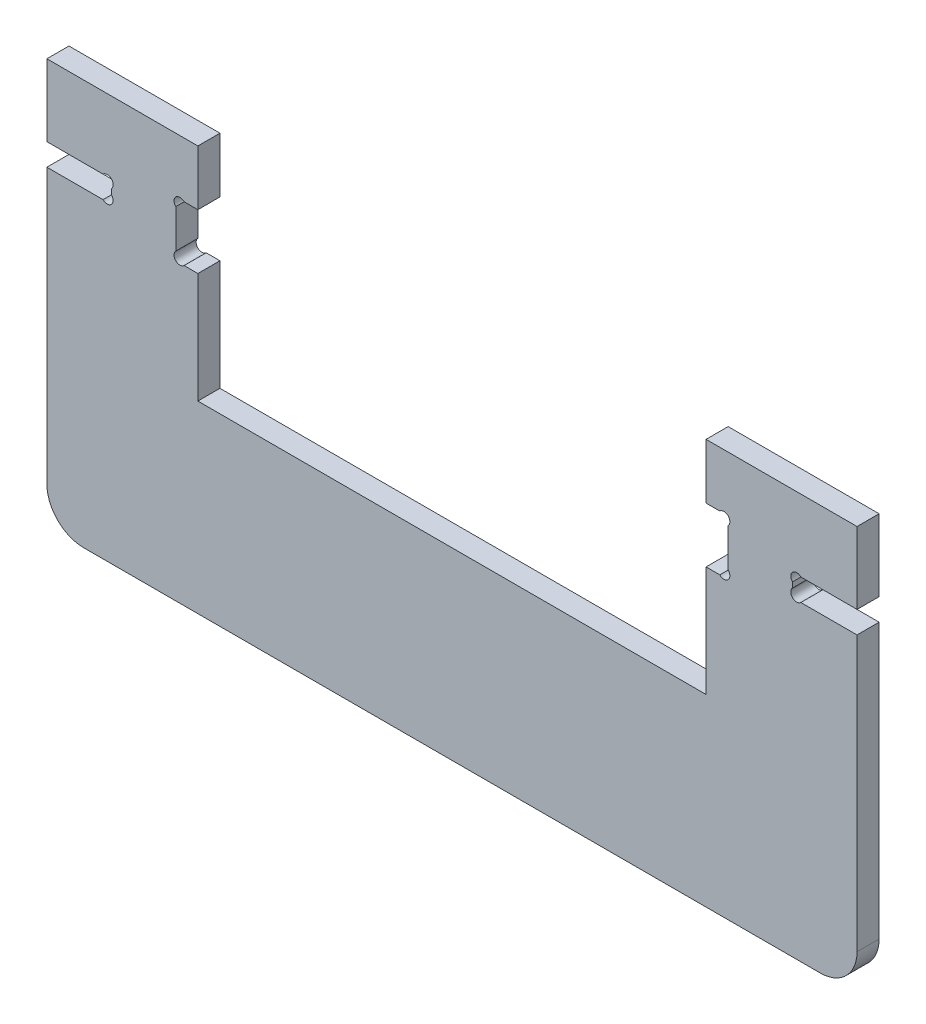
ISO-10303-21;
HEADER;
FILE_DESCRIPTION(('STEP AP214'),'2;1');
FILE_NAME('part.step','',(''),(''),'','','');
FILE_SCHEMA(('AUTOMOTIVE_DESIGN { 1 0 10303 214 1 1 1 1 }'));
ENDSEC;
DATA;
#1=APPLICATION_CONTEXT('core data for automotive mechanical design processes');
#2=APPLICATION_PROTOCOL_DEFINITION('international standard','automotive_design',2000,#1);
#3=PRODUCT_CONTEXT('',#1,'mechanical');
#4=PRODUCT('Part','Part','',(#3));
#5=PRODUCT_RELATED_PRODUCT_CATEGORY('part','',(#4));
#6=PRODUCT_DEFINITION_FORMATION('','',#4);
#7=PRODUCT_DEFINITION_CONTEXT('part definition',#1,'design');
#8=PRODUCT_DEFINITION('design','',#6,#7);
#9=PRODUCT_DEFINITION_SHAPE('','',#8);
#10=(LENGTH_UNIT() NAMED_UNIT(*) SI_UNIT(.MILLI.,.METRE.));
#11=(NAMED_UNIT(*) PLANE_ANGLE_UNIT() SI_UNIT($,.RADIAN.));
#12=(NAMED_UNIT(*) SI_UNIT($,.STERADIAN.) SOLID_ANGLE_UNIT());
#13=UNCERTAINTY_MEASURE_WITH_UNIT(LENGTH_MEASURE(1.E-05),#10,'distance_accuracy_value','');
#14=(GEOMETRIC_REPRESENTATION_CONTEXT(3) GLOBAL_UNCERTAINTY_ASSIGNED_CONTEXT((#13)) GLOBAL_UNIT_ASSIGNED_CONTEXT((#10,
#11,#12)) REPRESENTATION_CONTEXT('',''));
#15=CARTESIAN_POINT('',(0.,0.,0.));
#16=DIRECTION('',(0.,0.,1.));
#17=DIRECTION('',(1.,0.,0.));
#18=AXIS2_PLACEMENT_3D('',#15,#16,#17);
#19=CARTESIAN_POINT('',(36.1313708498985,93.8686291501015,6.));
#20=DIRECTION('',(0.,0.,-1.));
#21=DIRECTION('',(-1.,0.,0.));
#22=AXIS2_PLACEMENT_3D('',#19,#20,#21);
#23=CYLINDRICAL_SURFACE('',#22,1.60000000000003);
#24=CARTESIAN_POINT('',(36.1313708498985,93.8686291501015,0.));
#25=DIRECTION('',(0.,0.,-1.));
#26=DIRECTION('',(1.,0.,0.));
#27=AXIS2_PLACEMENT_3D('',#24,#25,#26);
#28=CIRCLE('',#27,1.60000000000003);
#29=CARTESIAN_POINT('',(35.,92.7372583002031,0.));
#30=VERTEX_POINT('',#29);
#31=CARTESIAN_POINT('',(37.2627416997971,95.,0.));
#32=VERTEX_POINT('',#31);
#33=EDGE_CURVE('E250',#30,#32,#28,.T.);
#34=ORIENTED_EDGE('',*,*,#33,.T.);
#35=DIRECTION('',(0.,0.,-1.));
#36=VECTOR('',#35,1.);
#37=CARTESIAN_POINT('',(37.2627416997971,95.,6.));
#38=LINE('',#37,#36);
#39=CARTESIAN_POINT('',(37.2627416997971,95.,6.));
#40=VERTEX_POINT('',#39);
#41=EDGE_CURVE('E11',#40,#32,#38,.T.);
#42=ORIENTED_EDGE('',*,*,#41,.F.);
#43=CARTESIAN_POINT('',(36.1313708498985,93.8686291501015,6.));
#44=DIRECTION('',(0.,0.,-1.));
#45=DIRECTION('',(1.,0.,0.));
#46=AXIS2_PLACEMENT_3D('',#43,#44,#45);
#47=CIRCLE('',#46,1.60000000000003);
#48=CARTESIAN_POINT('',(35.,92.7372583002031,6.));
#49=VERTEX_POINT('',#48);
#50=EDGE_CURVE('E329',#49,#40,#47,.T.);
#51=ORIENTED_EDGE('',*,*,#50,.F.);
#52=DIRECTION('',(0.,0.,-1.));
#53=VECTOR('',#52,1.);
#54=CARTESIAN_POINT('',(35.,92.7372583002031,6.));
#55=LINE('',#54,#53);
#56=EDGE_CURVE('E263',#49,#30,#55,.T.);
#57=ORIENTED_EDGE('',*,*,#56,.T.);
#58=EDGE_LOOP('',(#34,#42,#51,#57));
#59=FACE_BOUND('',#58,.T.);
#60=ADVANCED_FACE('F26',(#59),#23,.F.);
#61=CARTESIAN_POINT('',(41.,95.,6.));
#62=DIRECTION('',(0.,1.,0.));
#63=DIRECTION('',(-1.,0.,0.));
#64=AXIS2_PLACEMENT_3D('',#61,#62,#63);
#65=PLANE('',#64);
#66=DIRECTION('',(1.,0.,0.));
#67=VECTOR('',#66,1.);
#68=CARTESIAN_POINT('',(41.,95.,0.));
#69=LINE('',#68,#67);
#70=CARTESIAN_POINT('',(41.,95.,0.));
#71=VERTEX_POINT('',#70);
#72=EDGE_CURVE('E246',#32,#71,#69,.T.);
#73=ORIENTED_EDGE('',*,*,#72,.T.);
#74=DIRECTION('',(0.,0.,-1.));
#75=VECTOR('',#74,1.);
#76=CARTESIAN_POINT('',(41.,95.,6.));
#77=LINE('',#76,#75);
#78=CARTESIAN_POINT('',(41.,95.,6.));
#79=VERTEX_POINT('',#78);
#80=EDGE_CURVE('E33',#79,#71,#77,.T.);
#81=ORIENTED_EDGE('',*,*,#80,.F.);
#82=DIRECTION('',(1.,0.,0.));
#83=VECTOR('',#82,1.);
#84=CARTESIAN_POINT('',(41.,95.,6.));
#85=LINE('',#84,#83);
#86=EDGE_CURVE('E259',#40,#79,#85,.T.);
#87=ORIENTED_EDGE('',*,*,#86,.F.);
#88=ORIENTED_EDGE('',*,*,#41,.T.);
#89=EDGE_LOOP('',(#73,#81,#87,#88));
#90=FACE_BOUND('',#89,.T.);
#91=ADVANCED_FACE('F258',(#90),#65,.F.);
#92=CARTESIAN_POINT('',(41.,110.,6.));
#93=DIRECTION('',(-1.,0.,0.));
#94=DIRECTION('',(0.,0.,1.));
#95=AXIS2_PLACEMENT_3D('',#92,#93,#94);
#96=PLANE('',#95);
#97=DIRECTION('',(0.,1.,0.));
#98=VECTOR('',#97,1.);
#99=CARTESIAN_POINT('',(41.,110.,0.));
#100=LINE('',#99,#98);
#101=CARTESIAN_POINT('',(41.,110.,0.));
#102=VERTEX_POINT('',#101);
#103=EDGE_CURVE('E252',#71,#102,#100,.T.);
#104=ORIENTED_EDGE('',*,*,#103,.T.);
#105=DIRECTION('',(0.,0.,-1.));
#106=VECTOR('',#105,1.);
#107=CARTESIAN_POINT('',(41.,110.,6.));
#108=LINE('',#107,#106);
#109=CARTESIAN_POINT('',(41.,110.,6.));
#110=VERTEX_POINT('',#109);
#111=EDGE_CURVE('E485',#110,#102,#108,.T.);
#112=ORIENTED_EDGE('',*,*,#111,.F.);
#113=DIRECTION('',(0.,1.,0.));
#114=VECTOR('',#113,1.);
#115=CARTESIAN_POINT('',(41.,110.,6.));
#116=LINE('',#115,#114);
#117=EDGE_CURVE('E332',#79,#110,#116,.T.);
#118=ORIENTED_EDGE('',*,*,#117,.F.);
#119=ORIENTED_EDGE('',*,*,#80,.T.);
#120=EDGE_LOOP('',(#104,#112,#118,#119));
#121=FACE_BOUND('',#120,.T.);
#122=ADVANCED_FACE('F489',(#121),#96,.F.);
#123=CARTESIAN_POINT('',(0.,110.,6.));
#124=DIRECTION('',(0.,-1.,0.));
#125=DIRECTION('',(0.,0.,-1.));
#126=AXIS2_PLACEMENT_3D('',#123,#124,#125);
#127=PLANE('',#126);
#128=DIRECTION('',(-1.,0.,0.));
#129=VECTOR('',#128,1.);
#130=CARTESIAN_POINT('',(0.,110.,0.));
#131=LINE('',#130,#129);
#132=CARTESIAN_POINT('',(0.,110.,0.));
#133=VERTEX_POINT('',#132);
#134=EDGE_CURVE('E267',#102,#133,#131,.T.);
#135=ORIENTED_EDGE('',*,*,#134,.T.);
#136=DIRECTION('',(0.,0.,-1.));
#137=VECTOR('',#136,1.);
#138=CARTESIAN_POINT('',(0.,110.,6.));
#139=LINE('',#138,#137);
#140=CARTESIAN_POINT('',(0.,110.,6.));
#141=VERTEX_POINT('',#140);
#142=EDGE_CURVE('E482',#141,#133,#139,.T.);
#143=ORIENTED_EDGE('',*,*,#142,.F.);
#144=DIRECTION('',(-1.,0.,0.));
#145=VECTOR('',#144,1.);
#146=CARTESIAN_POINT('',(0.,110.,6.));
#147=LINE('',#146,#145);
#148=EDGE_CURVE('E334',#110,#141,#147,.T.);
#149=ORIENTED_EDGE('',*,*,#148,.F.);
#150=ORIENTED_EDGE('',*,*,#111,.T.);
#151=EDGE_LOOP('',(#135,#143,#149,#150));
#152=FACE_BOUND('',#151,.T.);
#153=ADVANCED_FACE('F497',(#152),#127,.F.);
#154=CARTESIAN_POINT('',(0.,110.,6.));
#155=DIRECTION('',(1.,0.,0.));
#156=DIRECTION('',(0.,0.,-1.));
#157=AXIS2_PLACEMENT_3D('',#154,#155,#156);
#158=PLANE('',#157);
#159=DIRECTION('',(0.,-1.,0.));
#160=VECTOR('',#159,1.);
#161=CARTESIAN_POINT('',(0.,110.,0.));
#162=LINE('',#161,#160);
#163=CARTESIAN_POINT('',(0.,90.5,0.));
#164=VERTEX_POINT('',#163);
#165=EDGE_CURVE('E269',#133,#164,#162,.T.);
#166=ORIENTED_EDGE('',*,*,#165,.T.);
#167=DIRECTION('',(0.,0.,-1.));
#168=VECTOR('',#167,1.);
#169=CARTESIAN_POINT('',(0.,90.5,6.));
#170=LINE('',#169,#168);
#171=CARTESIAN_POINT('',(0.,90.5,6.));
#172=VERTEX_POINT('',#171);
#173=EDGE_CURVE('E479',#172,#164,#170,.T.);
#174=ORIENTED_EDGE('',*,*,#173,.F.);
#175=DIRECTION('',(0.,-1.,0.));
#176=VECTOR('',#175,1.);
#177=CARTESIAN_POINT('',(0.,110.,6.));
#178=LINE('',#177,#176);
#179=EDGE_CURVE('E336',#141,#172,#178,.T.);
#180=ORIENTED_EDGE('',*,*,#179,.F.);
#181=ORIENTED_EDGE('',*,*,#142,.T.);
#182=EDGE_LOOP('',(#166,#174,#180,#181));
#183=FACE_BOUND('',#182,.T.);
#184=ADVANCED_FACE('F500',(#183),#158,.F.);
#185=CARTESIAN_POINT('',(0.,90.5,6.));
#186=DIRECTION('',(0.,1.,0.));
#187=DIRECTION('',(-1.,0.,0.));
#188=AXIS2_PLACEMENT_3D('',#185,#186,#187);
#189=PLANE('',#188);
#190=DIRECTION('',(1.,0.,0.));
#191=VECTOR('',#190,1.);
#192=CARTESIAN_POINT('',(0.,90.5,0.));
#193=LINE('',#192,#191);
#194=CARTESIAN_POINT('',(15.257258300203,90.5,0.));
#195=VERTEX_POINT('',#194);
#196=EDGE_CURVE('E271',#164,#195,#193,.T.);
#197=ORIENTED_EDGE('',*,*,#196,.T.);
#198=DIRECTION('',(0.,0.,-1.));
#199=VECTOR('',#198,1.);
#200=CARTESIAN_POINT('',(15.257258300203,90.5,6.));
#201=LINE('',#200,#199);
#202=CARTESIAN_POINT('',(15.257258300203,90.5,6.));
#203=VERTEX_POINT('',#202);
#204=EDGE_CURVE('E476',#203,#195,#201,.T.);
#205=ORIENTED_EDGE('',*,*,#204,.F.);
#206=DIRECTION('',(1.,0.,0.));
#207=VECTOR('',#206,1.);
#208=CARTESIAN_POINT('',(0.,90.5,6.));
#209=LINE('',#208,#207);
#210=EDGE_CURVE('E338',#172,#203,#209,.T.);
#211=ORIENTED_EDGE('',*,*,#210,.F.);
#212=ORIENTED_EDGE('',*,*,#173,.T.);
#213=EDGE_LOOP('',(#197,#205,#211,#212));
#214=FACE_BOUND('',#213,.T.);
#215=ADVANCED_FACE('F505',(#214),#189,.F.);
#216=CARTESIAN_POINT('',(16.3886291501015,89.3686291501015,6.));
#217=DIRECTION('',(0.,0.,-1.));
#218=DIRECTION('',(-1.,0.,0.));
#219=AXIS2_PLACEMENT_3D('',#216,#217,#218);
#220=CYLINDRICAL_SURFACE('',#219,1.60000000000002);
#221=CARTESIAN_POINT('',(16.3886291501015,89.3686291501015,0.));
#222=DIRECTION('',(0.,0.,-1.));
#223=DIRECTION('',(1.,0.,0.));
#224=AXIS2_PLACEMENT_3D('',#221,#222,#223);
#225=CIRCLE('',#224,1.60000000000002);
#226=CARTESIAN_POINT('',(17.52,88.237258300203,0.));
#227=VERTEX_POINT('',#226);
#228=EDGE_CURVE('E273',#195,#227,#225,.T.);
#229=ORIENTED_EDGE('',*,*,#228,.T.);
#230=DIRECTION('',(0.,0.,-1.));
#231=VECTOR('',#230,1.);
#232=CARTESIAN_POINT('',(17.52,88.237258300203,6.));
#233=LINE('',#232,#231);
#234=CARTESIAN_POINT('',(17.52,88.237258300203,6.));
#235=VERTEX_POINT('',#234);
#236=EDGE_CURVE('E473',#235,#227,#233,.T.);
#237=ORIENTED_EDGE('',*,*,#236,.F.);
#238=CARTESIAN_POINT('',(16.3886291501015,89.3686291501015,6.));
#239=DIRECTION('',(0.,0.,-1.));
#240=DIRECTION('',(1.,0.,0.));
#241=AXIS2_PLACEMENT_3D('',#238,#239,#240);
#242=CIRCLE('',#241,1.60000000000002);
#243=EDGE_CURVE('E340',#203,#235,#242,.T.);
#244=ORIENTED_EDGE('',*,*,#243,.F.);
#245=ORIENTED_EDGE('',*,*,#204,.T.);
#246=EDGE_LOOP('',(#229,#237,#244,#245));
#247=FACE_BOUND('',#246,.T.);
#248=ADVANCED_FACE('F511',(#247),#220,.F.);
#249=CARTESIAN_POINT('',(17.52,88.237258300203,6.));
#250=DIRECTION('',(1.,0.,0.));
#251=DIRECTION('',(0.,1.,0.));
#252=AXIS2_PLACEMENT_3D('',#249,#250,#251);
#253=PLANE('',#252);
#254=DIRECTION('',(0.,-1.,0.));
#255=VECTOR('',#254,1.);
#256=CARTESIAN_POINT('',(17.52,88.237258300203,0.));
#257=LINE('',#256,#255);
#258=CARTESIAN_POINT('',(17.52,86.7627416997969,0.));
#259=VERTEX_POINT('',#258);
#260=EDGE_CURVE('E275',#227,#259,#257,.T.);
#261=ORIENTED_EDGE('',*,*,#260,.T.);
#262=DIRECTION('',(0.,0.,-1.));
#263=VECTOR('',#262,1.);
#264=CARTESIAN_POINT('',(17.52,86.7627416997969,6.));
#265=LINE('',#264,#263);
#266=CARTESIAN_POINT('',(17.52,86.7627416997969,6.));
#267=VERTEX_POINT('',#266);
#268=EDGE_CURVE('E470',#267,#259,#265,.T.);
#269=ORIENTED_EDGE('',*,*,#268,.F.);
#270=DIRECTION('',(0.,-1.,0.));
#271=VECTOR('',#270,1.);
#272=CARTESIAN_POINT('',(17.52,88.237258300203,6.));
#273=LINE('',#272,#271);
#274=EDGE_CURVE('E342',#235,#267,#273,.T.);
#275=ORIENTED_EDGE('',*,*,#274,.F.);
#276=ORIENTED_EDGE('',*,*,#236,.T.);
#277=EDGE_LOOP('',(#261,#269,#275,#276));
#278=FACE_BOUND('',#277,.T.);
#279=ADVANCED_FACE('F515',(#278),#253,.F.);
#280=CARTESIAN_POINT('',(16.3886291501015,85.6313708498985,6.));
#281=DIRECTION('',(0.,0.,-1.));
#282=DIRECTION('',(-1.,0.,0.));
#283=AXIS2_PLACEMENT_3D('',#280,#281,#282);
#284=CYLINDRICAL_SURFACE('',#283,1.6);
#285=CARTESIAN_POINT('',(16.3886291501015,85.6313708498985,0.));
#286=DIRECTION('',(0.,0.,-1.));
#287=DIRECTION('',(-1.,0.,0.));
#288=AXIS2_PLACEMENT_3D('',#285,#286,#287);
#289=CIRCLE('',#288,1.6);
#290=CARTESIAN_POINT('',(15.257258300203,84.5,0.));
#291=VERTEX_POINT('',#290);
#292=EDGE_CURVE('E277',#259,#291,#289,.T.);
#293=ORIENTED_EDGE('',*,*,#292,.T.);
#294=DIRECTION('',(0.,0.,-1.));
#295=VECTOR('',#294,1.);
#296=CARTESIAN_POINT('',(15.257258300203,84.5,6.));
#297=LINE('',#296,#295);
#298=CARTESIAN_POINT('',(15.257258300203,84.5,6.));
#299=VERTEX_POINT('',#298);
#300=EDGE_CURVE('E467',#299,#291,#297,.T.);
#301=ORIENTED_EDGE('',*,*,#300,.F.);
#302=CARTESIAN_POINT('',(16.3886291501015,85.6313708498985,6.));
#303=DIRECTION('',(0.,0.,-1.));
#304=DIRECTION('',(-1.,0.,0.));
#305=AXIS2_PLACEMENT_3D('',#302,#303,#304);
#306=CIRCLE('',#305,1.6);
#307=EDGE_CURVE('E344',#267,#299,#306,.T.);
#308=ORIENTED_EDGE('',*,*,#307,.F.);
#309=ORIENTED_EDGE('',*,*,#268,.T.);
#310=EDGE_LOOP('',(#293,#301,#308,#309));
#311=FACE_BOUND('',#310,.T.);
#312=ADVANCED_FACE('F520',(#311),#284,.F.);
#313=CARTESIAN_POINT('',(0.,84.5,6.));
#314=DIRECTION('',(0.,-1.,0.));
#315=DIRECTION('',(0.,0.,-1.));
#316=AXIS2_PLACEMENT_3D('',#313,#314,#315);
#317=PLANE('',#316);
#318=DIRECTION('',(-1.,0.,0.));
#319=VECTOR('',#318,1.);
#320=CARTESIAN_POINT('',(0.,84.5,0.));
#321=LINE('',#320,#319);
#322=CARTESIAN_POINT('',(0.,84.5,0.));
#323=VERTEX_POINT('',#322);
#324=EDGE_CURVE('E279',#291,#323,#321,.T.);
#325=ORIENTED_EDGE('',*,*,#324,.T.);
#326=DIRECTION('',(0.,0.,-1.));
#327=VECTOR('',#326,1.);
#328=CARTESIAN_POINT('',(0.,84.5,6.));
#329=LINE('',#328,#327);
#330=CARTESIAN_POINT('',(0.,84.5,6.));
#331=VERTEX_POINT('',#330);
#332=EDGE_CURVE('E464',#331,#323,#329,.T.);
#333=ORIENTED_EDGE('',*,*,#332,.F.);
#334=DIRECTION('',(-1.,0.,0.));
#335=VECTOR('',#334,1.);
#336=CARTESIAN_POINT('',(0.,84.5,6.));
#337=LINE('',#336,#335);
#338=EDGE_CURVE('E346',#299,#331,#337,.T.);
#339=ORIENTED_EDGE('',*,*,#338,.F.);
#340=ORIENTED_EDGE('',*,*,#300,.T.);
#341=EDGE_LOOP('',(#325,#333,#339,#340));
#342=FACE_BOUND('',#341,.T.);
#343=ADVANCED_FACE('F526',(#342),#317,.F.);
#344=CARTESIAN_POINT('',(0.,84.5,6.));
#345=DIRECTION('',(1.,0.,0.));
#346=DIRECTION('',(0.,0.,-1.));
#347=AXIS2_PLACEMENT_3D('',#344,#345,#346);
#348=PLANE('',#347);
#349=DIRECTION('',(0.,-1.,0.));
#350=VECTOR('',#349,1.);
#351=CARTESIAN_POINT('',(0.,84.5,0.));
#352=LINE('',#351,#350);
#353=CARTESIAN_POINT('',(0.,10.0000000000001,0.));
#354=VERTEX_POINT('',#353);
#355=EDGE_CURVE('E281',#323,#354,#352,.T.);
#356=ORIENTED_EDGE('',*,*,#355,.T.);
#357=DIRECTION('',(0.,0.,-1.));
#358=VECTOR('',#357,1.);
#359=CARTESIAN_POINT('',(0.,10.0000000000001,6.));
#360=LINE('',#359,#358);
#361=CARTESIAN_POINT('',(0.,10.0000000000001,6.));
#362=VERTEX_POINT('',#361);
#363=EDGE_CURVE('E461',#362,#354,#360,.T.);
#364=ORIENTED_EDGE('',*,*,#363,.F.);
#365=DIRECTION('',(0.,-1.,0.));
#366=VECTOR('',#365,1.);
#367=CARTESIAN_POINT('',(0.,84.5,6.));
#368=LINE('',#367,#366);
#369=EDGE_CURVE('E348',#331,#362,#368,.T.);
#370=ORIENTED_EDGE('',*,*,#369,.F.);
#371=ORIENTED_EDGE('',*,*,#332,.T.);
#372=EDGE_LOOP('',(#356,#364,#370,#371));
#373=FACE_BOUND('',#372,.T.);
#374=ADVANCED_FACE('F530',(#373),#348,.F.);
#375=CARTESIAN_POINT('',(10.,9.99999999999998,6.));
#376=DIRECTION('',(0.,0.,-1.));
#377=DIRECTION('',(-1.,0.,0.));
#378=AXIS2_PLACEMENT_3D('',#375,#376,#377);
#379=CYLINDRICAL_SURFACE('',#378,10.);
#380=CARTESIAN_POINT('',(10.,9.99999999999998,0.));
#381=DIRECTION('',(0.,0.,1.));
#382=DIRECTION('',(1.,0.,0.));
#383=AXIS2_PLACEMENT_3D('',#380,#381,#382);
#384=CIRCLE('',#383,10.);
#385=CARTESIAN_POINT('',(10.0000000000001,0.,0.));
#386=VERTEX_POINT('',#385);
#387=EDGE_CURVE('E283',#354,#386,#384,.T.);
#388=ORIENTED_EDGE('',*,*,#387,.T.);
#389=DIRECTION('',(0.,0.,-1.));
#390=VECTOR('',#389,1.);
#391=CARTESIAN_POINT('',(10.0000000000001,0.,6.));
#392=LINE('',#391,#390);
#393=CARTESIAN_POINT('',(10.0000000000001,0.,6.));
#394=VERTEX_POINT('',#393);
#395=EDGE_CURVE('E458',#394,#386,#392,.T.);
#396=ORIENTED_EDGE('',*,*,#395,.F.);
#397=CARTESIAN_POINT('',(10.,9.99999999999998,6.));
#398=DIRECTION('',(0.,0.,1.));
#399=DIRECTION('',(1.,0.,0.));
#400=AXIS2_PLACEMENT_3D('',#397,#398,#399);
#401=CIRCLE('',#400,10.);
#402=EDGE_CURVE('E350',#362,#394,#401,.T.);
#403=ORIENTED_EDGE('',*,*,#402,.F.);
#404=ORIENTED_EDGE('',*,*,#363,.T.);
#405=EDGE_LOOP('',(#388,#396,#403,#404));
#406=FACE_BOUND('',#405,.T.);
#407=ADVANCED_FACE('F535',(#406),#379,.T.);
#408=CARTESIAN_POINT('',(10.0000000000001,0.,6.));
#409=DIRECTION('',(0.,1.,0.));
#410=DIRECTION('',(0.,0.,1.));
#411=AXIS2_PLACEMENT_3D('',#408,#409,#410);
#412=PLANE('',#411);
#413=DIRECTION('',(1.,0.,0.));
#414=VECTOR('',#413,1.);
#415=CARTESIAN_POINT('',(10.0000000000001,0.,0.));
#416=LINE('',#415,#414);
#417=CARTESIAN_POINT('',(210.,0.,0.));
#418=VERTEX_POINT('',#417);
#419=EDGE_CURVE('E285',#386,#418,#416,.T.);
#420=ORIENTED_EDGE('',*,*,#419,.T.);
#421=DIRECTION('',(0.,0.,-1.));
#422=VECTOR('',#421,1.);
#423=CARTESIAN_POINT('',(210.,0.,6.));
#424=LINE('',#423,#422);
#425=CARTESIAN_POINT('',(210.,0.,6.));
#426=VERTEX_POINT('',#425);
#427=EDGE_CURVE('E455',#426,#418,#424,.T.);
#428=ORIENTED_EDGE('',*,*,#427,.F.);
#429=DIRECTION('',(1.,0.,0.));
#430=VECTOR('',#429,1.);
#431=CARTESIAN_POINT('',(10.0000000000001,0.,6.));
#432=LINE('',#431,#430);
#433=EDGE_CURVE('E352',#394,#426,#432,.T.);
#434=ORIENTED_EDGE('',*,*,#433,.F.);
#435=ORIENTED_EDGE('',*,*,#395,.T.);
#436=EDGE_LOOP('',(#420,#428,#434,#435));
#437=FACE_BOUND('',#436,.T.);
#438=ADVANCED_FACE('F541',(#437),#412,.F.);
#439=CARTESIAN_POINT('',(210.,9.99999999999998,6.));
#440=DIRECTION('',(0.,0.,-1.));
#441=DIRECTION('',(-1.,0.,0.));
#442=AXIS2_PLACEMENT_3D('',#439,#440,#441);
#443=CYLINDRICAL_SURFACE('',#442,10.);
#444=CARTESIAN_POINT('',(210.,9.99999999999998,0.));
#445=DIRECTION('',(0.,0.,1.));
#446=DIRECTION('',(1.,0.,0.));
#447=AXIS2_PLACEMENT_3D('',#444,#445,#446);
#448=CIRCLE('',#447,10.);
#449=CARTESIAN_POINT('',(220.,10.0000000000001,0.));
#450=VERTEX_POINT('',#449);
#451=EDGE_CURVE('E287',#418,#450,#448,.T.);
#452=ORIENTED_EDGE('',*,*,#451,.T.);
#453=DIRECTION('',(0.,0.,-1.));
#454=VECTOR('',#453,1.);
#455=CARTESIAN_POINT('',(220.,10.0000000000001,6.));
#456=LINE('',#455,#454);
#457=CARTESIAN_POINT('',(220.,10.0000000000001,6.));
#458=VERTEX_POINT('',#457);
#459=EDGE_CURVE('E452',#458,#450,#456,.T.);
#460=ORIENTED_EDGE('',*,*,#459,.F.);
#461=CARTESIAN_POINT('',(210.,9.99999999999998,6.));
#462=DIRECTION('',(0.,0.,1.));
#463=DIRECTION('',(1.,0.,0.));
#464=AXIS2_PLACEMENT_3D('',#461,#462,#463);
#465=CIRCLE('',#464,10.);
#466=EDGE_CURVE('E354',#426,#458,#465,.T.);
#467=ORIENTED_EDGE('',*,*,#466,.F.);
#468=ORIENTED_EDGE('',*,*,#427,.T.);
#469=EDGE_LOOP('',(#452,#460,#467,#468));
#470=FACE_BOUND('',#469,.T.);
#471=ADVANCED_FACE('F545',(#470),#443,.T.);
#472=CARTESIAN_POINT('',(220.,84.4999999999999,6.));
#473=DIRECTION('',(-1.,0.,0.));
#474=DIRECTION('',(0.,0.,1.));
#475=AXIS2_PLACEMENT_3D('',#472,#473,#474);
#476=PLANE('',#475);
#477=DIRECTION('',(0.,1.,0.));
#478=VECTOR('',#477,1.);
#479=CARTESIAN_POINT('',(220.,84.4999999999999,0.));
#480=LINE('',#479,#478);
#481=CARTESIAN_POINT('',(220.,84.4999999999999,0.));
#482=VERTEX_POINT('',#481);
#483=EDGE_CURVE('E289',#450,#482,#480,.T.);
#484=ORIENTED_EDGE('',*,*,#483,.T.);
#485=DIRECTION('',(0.,0.,-1.));
#486=VECTOR('',#485,1.);
#487=CARTESIAN_POINT('',(220.,84.4999999999999,6.));
#488=LINE('',#487,#486);
#489=CARTESIAN_POINT('',(220.,84.4999999999999,6.));
#490=VERTEX_POINT('',#489);
#491=EDGE_CURVE('E449',#490,#482,#488,.T.);
#492=ORIENTED_EDGE('',*,*,#491,.F.);
#493=DIRECTION('',(0.,1.,0.));
#494=VECTOR('',#493,1.);
#495=CARTESIAN_POINT('',(220.,84.4999999999999,6.));
#496=LINE('',#495,#494);
#497=EDGE_CURVE('E356',#458,#490,#496,.T.);
#498=ORIENTED_EDGE('',*,*,#497,.F.);
#499=ORIENTED_EDGE('',*,*,#459,.T.);
#500=EDGE_LOOP('',(#484,#492,#498,#499));
#501=FACE_BOUND('',#500,.T.);
#502=ADVANCED_FACE('F550',(#501),#476,.F.);
#503=CARTESIAN_POINT('',(220.,84.4999999999999,6.));
#504=DIRECTION('',(0.,-1.,0.));
#505=DIRECTION('',(0.,0.,-1.));
#506=AXIS2_PLACEMENT_3D('',#503,#504,#505);
#507=PLANE('',#506);
#508=DIRECTION('',(-1.,0.,0.));
#509=VECTOR('',#508,1.);
#510=CARTESIAN_POINT('',(220.,84.4999999999999,0.));
#511=LINE('',#510,#509);
#512=CARTESIAN_POINT('',(204.742741699797,84.4999999999999,0.));
#513=VERTEX_POINT('',#512);
#514=EDGE_CURVE('E291',#482,#513,#511,.T.);
#515=ORIENTED_EDGE('',*,*,#514,.T.);
#516=DIRECTION('',(0.,0.,-1.));
#517=VECTOR('',#516,1.);
#518=CARTESIAN_POINT('',(204.742741699797,84.4999999999999,6.));
#519=LINE('',#518,#517);
#520=CARTESIAN_POINT('',(204.742741699797,84.4999999999999,6.));
#521=VERTEX_POINT('',#520);
#522=EDGE_CURVE('E446',#521,#513,#519,.T.);
#523=ORIENTED_EDGE('',*,*,#522,.F.);
#524=DIRECTION('',(-1.,0.,0.));
#525=VECTOR('',#524,1.);
#526=CARTESIAN_POINT('',(220.,84.4999999999999,6.));
#527=LINE('',#526,#525);
#528=EDGE_CURVE('E358',#490,#521,#527,.T.);
#529=ORIENTED_EDGE('',*,*,#528,.F.);
#530=ORIENTED_EDGE('',*,*,#491,.T.);
#531=EDGE_LOOP('',(#515,#523,#529,#530));
#532=FACE_BOUND('',#531,.T.);
#533=ADVANCED_FACE('F556',(#532),#507,.F.);
#534=CARTESIAN_POINT('',(203.611370849898,85.6313708498984,6.));
#535=DIRECTION('',(0.,0.,-1.));
#536=DIRECTION('',(-1.,0.,0.));
#537=AXIS2_PLACEMENT_3D('',#534,#535,#536);
#538=CYLINDRICAL_SURFACE('',#537,1.6);
#539=CARTESIAN_POINT('',(203.611370849898,85.6313708498984,0.));
#540=DIRECTION('',(0.,0.,-1.));
#541=DIRECTION('',(1.,0.,0.));
#542=AXIS2_PLACEMENT_3D('',#539,#540,#541);
#543=CIRCLE('',#542,1.6);
#544=CARTESIAN_POINT('',(202.48,86.7627416997969,0.));
#545=VERTEX_POINT('',#544);
#546=EDGE_CURVE('E293',#513,#545,#543,.T.);
#547=ORIENTED_EDGE('',*,*,#546,.T.);
#548=DIRECTION('',(0.,0.,-1.));
#549=VECTOR('',#548,1.);
#550=CARTESIAN_POINT('',(202.48,86.7627416997969,6.));
#551=LINE('',#550,#549);
#552=CARTESIAN_POINT('',(202.48,86.7627416997969,6.));
#553=VERTEX_POINT('',#552);
#554=EDGE_CURVE('E443',#553,#545,#551,.T.);
#555=ORIENTED_EDGE('',*,*,#554,.F.);
#556=CARTESIAN_POINT('',(203.611370849898,85.6313708498984,6.));
#557=DIRECTION('',(0.,0.,-1.));
#558=DIRECTION('',(1.,0.,0.));
#559=AXIS2_PLACEMENT_3D('',#556,#557,#558);
#560=CIRCLE('',#559,1.6);
#561=EDGE_CURVE('E360',#521,#553,#560,.T.);
#562=ORIENTED_EDGE('',*,*,#561,.F.);
#563=ORIENTED_EDGE('',*,*,#522,.T.);
#564=EDGE_LOOP('',(#547,#555,#562,#563));
#565=FACE_BOUND('',#564,.T.);
#566=ADVANCED_FACE('F560',(#565),#538,.F.);
#567=CARTESIAN_POINT('',(202.48,88.2372583002029,6.));
#568=DIRECTION('',(-1.,0.,0.));
#569=DIRECTION('',(0.,-1.,0.));
#570=AXIS2_PLACEMENT_3D('',#567,#568,#569);
#571=PLANE('',#570);
#572=DIRECTION('',(0.,1.,0.));
#573=VECTOR('',#572,1.);
#574=CARTESIAN_POINT('',(202.48,88.2372583002029,0.));
#575=LINE('',#574,#573);
#576=CARTESIAN_POINT('',(202.48,88.2372583002029,0.));
#577=VERTEX_POINT('',#576);
#578=EDGE_CURVE('E295',#545,#577,#575,.T.);
#579=ORIENTED_EDGE('',*,*,#578,.T.);
#580=DIRECTION('',(0.,0.,-1.));
#581=VECTOR('',#580,1.);
#582=CARTESIAN_POINT('',(202.48,88.2372583002029,6.));
#583=LINE('',#582,#581);
#584=CARTESIAN_POINT('',(202.48,88.2372583002029,6.));
#585=VERTEX_POINT('',#584);
#586=EDGE_CURVE('E440',#585,#577,#583,.T.);
#587=ORIENTED_EDGE('',*,*,#586,.F.);
#588=DIRECTION('',(0.,1.,0.));
#589=VECTOR('',#588,1.);
#590=CARTESIAN_POINT('',(202.48,88.2372583002029,6.));
#591=LINE('',#590,#589);
#592=EDGE_CURVE('E362',#553,#585,#591,.T.);
#593=ORIENTED_EDGE('',*,*,#592,.F.);
#594=ORIENTED_EDGE('',*,*,#554,.T.);
#595=EDGE_LOOP('',(#579,#587,#593,#594));
#596=FACE_BOUND('',#595,.T.);
#597=ADVANCED_FACE('F565',(#596),#571,.F.);
#598=CARTESIAN_POINT('',(203.611370849898,89.3686291501015,6.));
#599=DIRECTION('',(0.,0.,-1.));
#600=DIRECTION('',(-1.,0.,0.));
#601=AXIS2_PLACEMENT_3D('',#598,#599,#600);
#602=CYLINDRICAL_SURFACE('',#601,1.60000000000002);
#603=CARTESIAN_POINT('',(203.611370849898,89.3686291501015,0.));
#604=DIRECTION('',(0.,0.,-1.));
#605=DIRECTION('',(-1.,0.,0.));
#606=AXIS2_PLACEMENT_3D('',#603,#604,#605);
#607=CIRCLE('',#606,1.60000000000002);
#608=CARTESIAN_POINT('',(204.742741699797,90.5,0.));
#609=VERTEX_POINT('',#608);
#610=EDGE_CURVE('E297',#577,#609,#607,.T.);
#611=ORIENTED_EDGE('',*,*,#610,.T.);
#612=DIRECTION('',(0.,0.,-1.));
#613=VECTOR('',#612,1.);
#614=CARTESIAN_POINT('',(204.742741699797,90.5,6.));
#615=LINE('',#614,#613);
#616=CARTESIAN_POINT('',(204.742741699797,90.5,6.));
#617=VERTEX_POINT('',#616);
#618=EDGE_CURVE('E437',#617,#609,#615,.T.);
#619=ORIENTED_EDGE('',*,*,#618,.F.);
#620=CARTESIAN_POINT('',(203.611370849898,89.3686291501015,6.));
#621=DIRECTION('',(0.,0.,-1.));
#622=DIRECTION('',(-1.,0.,0.));
#623=AXIS2_PLACEMENT_3D('',#620,#621,#622);
#624=CIRCLE('',#623,1.60000000000002);
#625=EDGE_CURVE('E364',#585,#617,#624,.T.);
#626=ORIENTED_EDGE('',*,*,#625,.F.);
#627=ORIENTED_EDGE('',*,*,#586,.T.);
#628=EDGE_LOOP('',(#611,#619,#626,#627));
#629=FACE_BOUND('',#628,.T.);
#630=ADVANCED_FACE('F571',(#629),#602,.F.);
#631=CARTESIAN_POINT('',(220.,90.4999999999999,6.));
#632=DIRECTION('',(0.,1.,0.));
#633=DIRECTION('',(-1.,0.,0.));
#634=AXIS2_PLACEMENT_3D('',#631,#632,#633);
#635=PLANE('',#634);
#636=DIRECTION('',(1.,0.,0.));
#637=VECTOR('',#636,1.);
#638=CARTESIAN_POINT('',(220.,90.4999999999999,0.));
#639=LINE('',#638,#637);
#640=CARTESIAN_POINT('',(220.,90.4999999999999,0.));
#641=VERTEX_POINT('',#640);
#642=EDGE_CURVE('E299',#609,#641,#639,.T.);
#643=ORIENTED_EDGE('',*,*,#642,.T.);
#644=DIRECTION('',(0.,0.,-1.));
#645=VECTOR('',#644,1.);
#646=CARTESIAN_POINT('',(220.,90.4999999999999,6.));
#647=LINE('',#646,#645);
#648=CARTESIAN_POINT('',(220.,90.4999999999999,6.));
#649=VERTEX_POINT('',#648);
#650=EDGE_CURVE('E434',#649,#641,#647,.T.);
#651=ORIENTED_EDGE('',*,*,#650,.F.);
#652=DIRECTION('',(1.,0.,0.));
#653=VECTOR('',#652,1.);
#654=CARTESIAN_POINT('',(220.,90.4999999999999,6.));
#655=LINE('',#654,#653);
#656=EDGE_CURVE('E366',#617,#649,#655,.T.);
#657=ORIENTED_EDGE('',*,*,#656,.F.);
#658=ORIENTED_EDGE('',*,*,#618,.T.);
#659=EDGE_LOOP('',(#643,#651,#657,#658));
#660=FACE_BOUND('',#659,.T.);
#661=ADVANCED_FACE('F575',(#660),#635,.F.);
#662=CARTESIAN_POINT('',(220.,110.,6.));
#663=DIRECTION('',(-1.,0.,0.));
#664=DIRECTION('',(0.,0.,1.));
#665=AXIS2_PLACEMENT_3D('',#662,#663,#664);
#666=PLANE('',#665);
#667=DIRECTION('',(0.,1.,0.));
#668=VECTOR('',#667,1.);
#669=CARTESIAN_POINT('',(220.,110.,0.));
#670=LINE('',#669,#668);
#671=CARTESIAN_POINT('',(220.,110.,0.));
#672=VERTEX_POINT('',#671);
#673=EDGE_CURVE('E301',#641,#672,#670,.T.);
#674=ORIENTED_EDGE('',*,*,#673,.T.);
#675=DIRECTION('',(0.,0.,-1.));
#676=VECTOR('',#675,1.);
#677=CARTESIAN_POINT('',(220.,110.,6.));
#678=LINE('',#677,#676);
#679=CARTESIAN_POINT('',(220.,110.,6.));
#680=VERTEX_POINT('',#679);
#681=EDGE_CURVE('E431',#680,#672,#678,.T.);
#682=ORIENTED_EDGE('',*,*,#681,.F.);
#683=DIRECTION('',(0.,1.,0.));
#684=VECTOR('',#683,1.);
#685=CARTESIAN_POINT('',(220.,110.,6.));
#686=LINE('',#685,#684);
#687=EDGE_CURVE('E368',#649,#680,#686,.T.);
#688=ORIENTED_EDGE('',*,*,#687,.F.);
#689=ORIENTED_EDGE('',*,*,#650,.T.);
#690=EDGE_LOOP('',(#674,#682,#688,#689));
#691=FACE_BOUND('',#690,.T.);
#692=ADVANCED_FACE('F580',(#691),#666,.F.);
#693=CARTESIAN_POINT('',(179.,110.,6.));
#694=DIRECTION('',(0.,-1.,0.));
#695=DIRECTION('',(0.,0.,-1.));
#696=AXIS2_PLACEMENT_3D('',#693,#694,#695);
#697=PLANE('',#696);
#698=DIRECTION('',(-1.,0.,0.));
#699=VECTOR('',#698,1.);
#700=CARTESIAN_POINT('',(179.,110.,0.));
#701=LINE('',#700,#699);
#702=CARTESIAN_POINT('',(179.,110.,0.));
#703=VERTEX_POINT('',#702);
#704=EDGE_CURVE('E303',#672,#703,#701,.T.);
#705=ORIENTED_EDGE('',*,*,#704,.T.);
#706=DIRECTION('',(0.,0.,-1.));
#707=VECTOR('',#706,1.);
#708=CARTESIAN_POINT('',(179.,110.,6.));
#709=LINE('',#708,#707);
#710=CARTESIAN_POINT('',(179.,110.,6.));
#711=VERTEX_POINT('',#710);
#712=EDGE_CURVE('E428',#711,#703,#709,.T.);
#713=ORIENTED_EDGE('',*,*,#712,.F.);
#714=DIRECTION('',(-1.,0.,0.));
#715=VECTOR('',#714,1.);
#716=CARTESIAN_POINT('',(179.,110.,6.));
#717=LINE('',#716,#715);
#718=EDGE_CURVE('E370',#680,#711,#717,.T.);
#719=ORIENTED_EDGE('',*,*,#718,.F.);
#720=ORIENTED_EDGE('',*,*,#681,.T.);
#721=EDGE_LOOP('',(#705,#713,#719,#720));
#722=FACE_BOUND('',#721,.T.);
#723=ADVANCED_FACE('F586',(#722),#697,.F.);
#724=CARTESIAN_POINT('',(179.,110.,6.));
#725=DIRECTION('',(1.,0.,0.));
#726=DIRECTION('',(0.,0.,-1.));
#727=AXIS2_PLACEMENT_3D('',#724,#725,#726);
#728=PLANE('',#727);
#729=DIRECTION('',(0.,-1.,0.));
#730=VECTOR('',#729,1.);
#731=CARTESIAN_POINT('',(179.,110.,0.));
#732=LINE('',#731,#730);
#733=CARTESIAN_POINT('',(179.,94.9999999999999,0.));
#734=VERTEX_POINT('',#733);
#735=EDGE_CURVE('E305',#703,#734,#732,.T.);
#736=ORIENTED_EDGE('',*,*,#735,.T.);
#737=DIRECTION('',(0.,0.,-1.));
#738=VECTOR('',#737,1.);
#739=CARTESIAN_POINT('',(179.,94.9999999999999,6.));
#740=LINE('',#739,#738);
#741=CARTESIAN_POINT('',(179.,94.9999999999999,6.));
#742=VERTEX_POINT('',#741);
#743=EDGE_CURVE('E425',#742,#734,#740,.T.);
#744=ORIENTED_EDGE('',*,*,#743,.F.);
#745=DIRECTION('',(0.,-1.,0.));
#746=VECTOR('',#745,1.);
#747=CARTESIAN_POINT('',(179.,110.,6.));
#748=LINE('',#747,#746);
#749=EDGE_CURVE('E372',#711,#742,#748,.T.);
#750=ORIENTED_EDGE('',*,*,#749,.F.);
#751=ORIENTED_EDGE('',*,*,#712,.T.);
#752=EDGE_LOOP('',(#736,#744,#750,#751));
#753=FACE_BOUND('',#752,.T.);
#754=ADVANCED_FACE('F590',(#753),#728,.F.);
#755=CARTESIAN_POINT('',(179.,94.9999999999999,6.));
#756=DIRECTION('',(0.,1.,0.));
#757=DIRECTION('',(0.,0.,1.));
#758=AXIS2_PLACEMENT_3D('',#755,#756,#757);
#759=PLANE('',#758);
#760=DIRECTION('',(1.,0.,0.));
#761=VECTOR('',#760,1.);
#762=CARTESIAN_POINT('',(179.,94.9999999999999,0.));
#763=LINE('',#762,#761);
#764=CARTESIAN_POINT('',(182.737258300203,94.9999999999999,0.));
#765=VERTEX_POINT('',#764);
#766=EDGE_CURVE('E307',#734,#765,#763,.T.);
#767=ORIENTED_EDGE('',*,*,#766,.T.);
#768=DIRECTION('',(0.,0.,-1.));
#769=VECTOR('',#768,1.);
#770=CARTESIAN_POINT('',(182.737258300203,94.9999999999999,6.));
#771=LINE('',#770,#769);
#772=CARTESIAN_POINT('',(182.737258300203,94.9999999999999,6.));
#773=VERTEX_POINT('',#772);
#774=EDGE_CURVE('E422',#773,#765,#771,.T.);
#775=ORIENTED_EDGE('',*,*,#774,.F.);
#776=DIRECTION('',(1.,0.,0.));
#777=VECTOR('',#776,1.);
#778=CARTESIAN_POINT('',(179.,94.9999999999999,6.));
#779=LINE('',#778,#777);
#780=EDGE_CURVE('E374',#742,#773,#779,.T.);
#781=ORIENTED_EDGE('',*,*,#780,.F.);
#782=ORIENTED_EDGE('',*,*,#743,.T.);
#783=EDGE_LOOP('',(#767,#775,#781,#782));
#784=FACE_BOUND('',#783,.T.);
#785=ADVANCED_FACE('F595',(#784),#759,.F.);
#786=CARTESIAN_POINT('',(183.868629150102,93.8686291501014,6.));
#787=DIRECTION('',(0.,0.,-1.));
#788=DIRECTION('',(-1.,0.,0.));
#789=AXIS2_PLACEMENT_3D('',#786,#787,#788);
#790=CYLINDRICAL_SURFACE('',#789,1.59999999999997);
#791=CARTESIAN_POINT('',(183.868629150102,93.8686291501014,0.));
#792=DIRECTION('',(0.,0.,-1.));
#793=DIRECTION('',(-1.,0.,0.));
#794=AXIS2_PLACEMENT_3D('',#791,#792,#793);
#795=CIRCLE('',#794,1.59999999999997);
#796=CARTESIAN_POINT('',(185.,92.737258300203,0.));
#797=VERTEX_POINT('',#796);
#798=EDGE_CURVE('E309',#765,#797,#795,.T.);
#799=ORIENTED_EDGE('',*,*,#798,.T.);
#800=DIRECTION('',(0.,0.,-1.));
#801=VECTOR('',#800,1.);
#802=CARTESIAN_POINT('',(185.,92.737258300203,6.));
#803=LINE('',#802,#801);
#804=CARTESIAN_POINT('',(185.,92.737258300203,6.));
#805=VERTEX_POINT('',#804);
#806=EDGE_CURVE('E419',#805,#797,#803,.T.);
#807=ORIENTED_EDGE('',*,*,#806,.F.);
#808=CARTESIAN_POINT('',(183.868629150102,93.8686291501014,6.));
#809=DIRECTION('',(0.,0.,-1.));
#810=DIRECTION('',(-1.,0.,0.));
#811=AXIS2_PLACEMENT_3D('',#808,#809,#810);
#812=CIRCLE('',#811,1.59999999999997);
#813=EDGE_CURVE('E376',#773,#805,#812,.T.);
#814=ORIENTED_EDGE('',*,*,#813,.F.);
#815=ORIENTED_EDGE('',*,*,#774,.T.);
#816=EDGE_LOOP('',(#799,#807,#814,#815));
#817=FACE_BOUND('',#816,.T.);
#818=ADVANCED_FACE('F601',(#817),#790,.F.);
#819=CARTESIAN_POINT('',(185.,92.737258300203,6.));
#820=DIRECTION('',(1.,0.,0.));
#821=DIRECTION('',(0.,1.,0.));
#822=AXIS2_PLACEMENT_3D('',#819,#820,#821);
#823=PLANE('',#822);
#824=DIRECTION('',(0.,-1.,0.));
#825=VECTOR('',#824,1.);
#826=CARTESIAN_POINT('',(185.,92.737258300203,0.));
#827=LINE('',#826,#825);
#828=CARTESIAN_POINT('',(185.,82.2627416997969,0.));
#829=VERTEX_POINT('',#828);
#830=EDGE_CURVE('E311',#797,#829,#827,.T.);
#831=ORIENTED_EDGE('',*,*,#830,.T.);
#832=DIRECTION('',(0.,0.,-1.));
#833=VECTOR('',#832,1.);
#834=CARTESIAN_POINT('',(185.,82.2627416997969,6.));
#835=LINE('',#834,#833);
#836=CARTESIAN_POINT('',(185.,82.2627416997969,6.));
#837=VERTEX_POINT('',#836);
#838=EDGE_CURVE('E416',#837,#829,#835,.T.);
#839=ORIENTED_EDGE('',*,*,#838,.F.);
#840=DIRECTION('',(0.,-1.,0.));
#841=VECTOR('',#840,1.);
#842=CARTESIAN_POINT('',(185.,92.737258300203,6.));
#843=LINE('',#842,#841);
#844=EDGE_CURVE('E378',#805,#837,#843,.T.);
#845=ORIENTED_EDGE('',*,*,#844,.F.);
#846=ORIENTED_EDGE('',*,*,#806,.T.);
#847=EDGE_LOOP('',(#831,#839,#845,#846));
#848=FACE_BOUND('',#847,.T.);
#849=ADVANCED_FACE('F605',(#848),#823,.F.);
#850=CARTESIAN_POINT('',(183.868629150102,81.1313708498984,6.));
#851=DIRECTION('',(0.,0.,-1.));
#852=DIRECTION('',(-1.,0.,0.));
#853=AXIS2_PLACEMENT_3D('',#850,#851,#852);
#854=CYLINDRICAL_SURFACE('',#853,1.59999999999997);
#855=CARTESIAN_POINT('',(183.868629150102,81.1313708498984,0.));
#856=DIRECTION('',(0.,0.,-1.));
#857=DIRECTION('',(1.,0.,0.));
#858=AXIS2_PLACEMENT_3D('',#855,#856,#857);
#859=CIRCLE('',#858,1.59999999999997);
#860=CARTESIAN_POINT('',(182.737258300203,79.9999999999999,0.));
#861=VERTEX_POINT('',#860);
#862=EDGE_CURVE('E313',#829,#861,#859,.T.);
#863=ORIENTED_EDGE('',*,*,#862,.T.);
#864=DIRECTION('',(0.,0.,-1.));
#865=VECTOR('',#864,1.);
#866=CARTESIAN_POINT('',(182.737258300203,79.9999999999999,6.));
#867=LINE('',#866,#865);
#868=CARTESIAN_POINT('',(182.737258300203,79.9999999999999,6.));
#869=VERTEX_POINT('',#868);
#870=EDGE_CURVE('E413',#869,#861,#867,.T.);
#871=ORIENTED_EDGE('',*,*,#870,.F.);
#872=CARTESIAN_POINT('',(183.868629150102,81.1313708498984,6.));
#873=DIRECTION('',(0.,0.,-1.));
#874=DIRECTION('',(1.,0.,0.));
#875=AXIS2_PLACEMENT_3D('',#872,#873,#874);
#876=CIRCLE('',#875,1.59999999999997);
#877=EDGE_CURVE('E380',#837,#869,#876,.T.);
#878=ORIENTED_EDGE('',*,*,#877,.F.);
#879=ORIENTED_EDGE('',*,*,#838,.T.);
#880=EDGE_LOOP('',(#863,#871,#878,#879));
#881=FACE_BOUND('',#880,.T.);
#882=ADVANCED_FACE('F610',(#881),#854,.F.);
#883=CARTESIAN_POINT('',(182.737258300203,79.9999999999999,6.));
#884=DIRECTION('',(0.,-1.,0.));
#885=DIRECTION('',(0.,0.,-1.));
#886=AXIS2_PLACEMENT_3D('',#883,#884,#885);
#887=PLANE('',#886);
#888=DIRECTION('',(-1.,0.,0.));
#889=VECTOR('',#888,1.);
#890=CARTESIAN_POINT('',(182.737258300203,79.9999999999999,0.));
#891=LINE('',#890,#889);
#892=CARTESIAN_POINT('',(179.,79.9999999999999,0.));
#893=VERTEX_POINT('',#892);
#894=EDGE_CURVE('E315',#861,#893,#891,.T.);
#895=ORIENTED_EDGE('',*,*,#894,.T.);
#896=DIRECTION('',(0.,0.,-1.));
#897=VECTOR('',#896,1.);
#898=CARTESIAN_POINT('',(179.,79.9999999999999,6.));
#899=LINE('',#898,#897);
#900=CARTESIAN_POINT('',(179.,79.9999999999999,6.));
#901=VERTEX_POINT('',#900);
#902=EDGE_CURVE('E410',#901,#893,#899,.T.);
#903=ORIENTED_EDGE('',*,*,#902,.F.);
#904=DIRECTION('',(-1.,0.,0.));
#905=VECTOR('',#904,1.);
#906=CARTESIAN_POINT('',(182.737258300203,79.9999999999999,6.));
#907=LINE('',#906,#905);
#908=EDGE_CURVE('E382',#869,#901,#907,.T.);
#909=ORIENTED_EDGE('',*,*,#908,.F.);
#910=ORIENTED_EDGE('',*,*,#870,.T.);
#911=EDGE_LOOP('',(#895,#903,#909,#910));
#912=FACE_BOUND('',#911,.T.);
#913=ADVANCED_FACE('F616',(#912),#887,.F.);
#914=CARTESIAN_POINT('',(179.,79.9999999999999,6.));
#915=DIRECTION('',(1.,0.,0.));
#916=DIRECTION('',(0.,0.,-1.));
#917=AXIS2_PLACEMENT_3D('',#914,#915,#916);
#918=PLANE('',#917);
#919=DIRECTION('',(0.,-1.,0.));
#920=VECTOR('',#919,1.);
#921=CARTESIAN_POINT('',(179.,79.9999999999999,0.));
#922=LINE('',#921,#920);
#923=CARTESIAN_POINT('',(179.,49.9999999999999,0.));
#924=VERTEX_POINT('',#923);
#925=EDGE_CURVE('E317',#893,#924,#922,.T.);
#926=ORIENTED_EDGE('',*,*,#925,.T.);
#927=DIRECTION('',(0.,0.,-1.));
#928=VECTOR('',#927,1.);
#929=CARTESIAN_POINT('',(179.,49.9999999999999,6.));
#930=LINE('',#929,#928);
#931=CARTESIAN_POINT('',(179.,49.9999999999999,6.));
#932=VERTEX_POINT('',#931);
#933=EDGE_CURVE('E407',#932,#924,#930,.T.);
#934=ORIENTED_EDGE('',*,*,#933,.F.);
#935=DIRECTION('',(0.,-1.,0.));
#936=VECTOR('',#935,1.);
#937=CARTESIAN_POINT('',(179.,79.9999999999999,6.));
#938=LINE('',#937,#936);
#939=EDGE_CURVE('E384',#901,#932,#938,.T.);
#940=ORIENTED_EDGE('',*,*,#939,.F.);
#941=ORIENTED_EDGE('',*,*,#902,.T.);
#942=EDGE_LOOP('',(#926,#934,#940,#941));
#943=FACE_BOUND('',#942,.T.);
#944=ADVANCED_FACE('F620',(#943),#918,.F.);
#945=CARTESIAN_POINT('',(41.,50.,6.));
#946=DIRECTION('',(0.,-1.,0.));
#947=DIRECTION('',(1.,0.,0.));
#948=AXIS2_PLACEMENT_3D('',#945,#946,#947);
#949=PLANE('',#948);
#950=DIRECTION('',(-1.,0.,0.));
#951=VECTOR('',#950,1.);
#952=CARTESIAN_POINT('',(41.,50.,0.));
#953=LINE('',#952,#951);
#954=CARTESIAN_POINT('',(41.,50.,0.));
#955=VERTEX_POINT('',#954);
#956=EDGE_CURVE('E319',#924,#955,#953,.T.);
#957=ORIENTED_EDGE('',*,*,#956,.T.);
#958=DIRECTION('',(0.,0.,-1.));
#959=VECTOR('',#958,1.);
#960=CARTESIAN_POINT('',(41.,50.,6.));
#961=LINE('',#960,#959);
#962=CARTESIAN_POINT('',(41.,50.,6.));
#963=VERTEX_POINT('',#962);
#964=EDGE_CURVE('E404',#963,#955,#961,.T.);
#965=ORIENTED_EDGE('',*,*,#964,.F.);
#966=DIRECTION('',(-1.,0.,0.));
#967=VECTOR('',#966,1.);
#968=CARTESIAN_POINT('',(41.,50.,6.));
#969=LINE('',#968,#967);
#970=EDGE_CURVE('E386',#932,#963,#969,.T.);
#971=ORIENTED_EDGE('',*,*,#970,.F.);
#972=ORIENTED_EDGE('',*,*,#933,.T.);
#973=EDGE_LOOP('',(#957,#965,#971,#972));
#974=FACE_BOUND('',#973,.T.);
#975=ADVANCED_FACE('F625',(#974),#949,.F.);
#976=CARTESIAN_POINT('',(41.,80.,6.));
#977=DIRECTION('',(-1.,0.,0.));
#978=DIRECTION('',(0.,0.,1.));
#979=AXIS2_PLACEMENT_3D('',#976,#977,#978);
#980=PLANE('',#979);
#981=DIRECTION('',(0.,1.,0.));
#982=VECTOR('',#981,1.);
#983=CARTESIAN_POINT('',(41.,80.,0.));
#984=LINE('',#983,#982);
#985=CARTESIAN_POINT('',(41.,80.,0.));
#986=VERTEX_POINT('',#985);
#987=EDGE_CURVE('E321',#955,#986,#984,.T.);
#988=ORIENTED_EDGE('',*,*,#987,.T.);
#989=DIRECTION('',(0.,0.,-1.));
#990=VECTOR('',#989,1.);
#991=CARTESIAN_POINT('',(41.,80.,6.));
#992=LINE('',#991,#990);
#993=CARTESIAN_POINT('',(41.,80.,6.));
#994=VERTEX_POINT('',#993);
#995=EDGE_CURVE('E401',#994,#986,#992,.T.);
#996=ORIENTED_EDGE('',*,*,#995,.F.);
#997=DIRECTION('',(0.,1.,0.));
#998=VECTOR('',#997,1.);
#999=CARTESIAN_POINT('',(41.,80.,6.));
#1000=LINE('',#999,#998);
#1001=EDGE_CURVE('E388',#963,#994,#1000,.T.);
#1002=ORIENTED_EDGE('',*,*,#1001,.F.);
#1003=ORIENTED_EDGE('',*,*,#964,.T.);
#1004=EDGE_LOOP('',(#988,#996,#1002,#1003));
#1005=FACE_BOUND('',#1004,.T.);
#1006=ADVANCED_FACE('F631',(#1005),#980,.F.);
#1007=CARTESIAN_POINT('',(37.262741699797,80.,6.));
#1008=DIRECTION('',(0.,-1.,0.));
#1009=DIRECTION('',(0.,0.,-1.));
#1010=AXIS2_PLACEMENT_3D('',#1007,#1008,#1009);
#1011=PLANE('',#1010);
#1012=DIRECTION('',(-1.,0.,0.));
#1013=VECTOR('',#1012,1.);
#1014=CARTESIAN_POINT('',(37.262741699797,80.,0.));
#1015=LINE('',#1014,#1013);
#1016=CARTESIAN_POINT('',(37.262741699797,80.,0.));
#1017=VERTEX_POINT('',#1016);
#1018=EDGE_CURVE('E323',#986,#1017,#1015,.T.);
#1019=ORIENTED_EDGE('',*,*,#1018,.T.);
#1020=DIRECTION('',(0.,0.,-1.));
#1021=VECTOR('',#1020,1.);
#1022=CARTESIAN_POINT('',(37.262741699797,80.,6.));
#1023=LINE('',#1022,#1021);
#1024=CARTESIAN_POINT('',(37.262741699797,80.,6.));
#1025=VERTEX_POINT('',#1024);
#1026=EDGE_CURVE('E398',#1025,#1017,#1023,.T.);
#1027=ORIENTED_EDGE('',*,*,#1026,.F.);
#1028=DIRECTION('',(-1.,0.,0.));
#1029=VECTOR('',#1028,1.);
#1030=CARTESIAN_POINT('',(37.262741699797,80.,6.));
#1031=LINE('',#1030,#1029);
#1032=EDGE_CURVE('E390',#994,#1025,#1031,.T.);
#1033=ORIENTED_EDGE('',*,*,#1032,.F.);
#1034=ORIENTED_EDGE('',*,*,#995,.T.);
#1035=EDGE_LOOP('',(#1019,#1027,#1033,#1034));
#1036=FACE_BOUND('',#1035,.T.);
#1037=ADVANCED_FACE('F635',(#1036),#1011,.F.);
#1038=CARTESIAN_POINT('',(36.1313708498985,81.1313708498985,6.));
#1039=DIRECTION('',(0.,0.,-1.));
#1040=DIRECTION('',(-1.,0.,0.));
#1041=AXIS2_PLACEMENT_3D('',#1038,#1039,#1040);
#1042=CYLINDRICAL_SURFACE('',#1041,1.59999999999999);
#1043=CARTESIAN_POINT('',(36.1313708498985,81.1313708498985,0.));
#1044=DIRECTION('',(0.,0.,-1.));
#1045=DIRECTION('',(-1.,0.,0.));
#1046=AXIS2_PLACEMENT_3D('',#1043,#1044,#1045);
#1047=CIRCLE('',#1046,1.59999999999999);
#1048=CARTESIAN_POINT('',(35.,82.2627416997969,0.));
#1049=VERTEX_POINT('',#1048);
#1050=EDGE_CURVE('E325',#1017,#1049,#1047,.T.);
#1051=ORIENTED_EDGE('',*,*,#1050,.T.);
#1052=DIRECTION('',(0.,0.,-1.));
#1053=VECTOR('',#1052,1.);
#1054=CARTESIAN_POINT('',(35.,82.2627416997969,6.));
#1055=LINE('',#1054,#1053);
#1056=CARTESIAN_POINT('',(35.,82.2627416997969,6.));
#1057=VERTEX_POINT('',#1056);
#1058=EDGE_CURVE('E395',#1057,#1049,#1055,.T.);
#1059=ORIENTED_EDGE('',*,*,#1058,.F.);
#1060=CARTESIAN_POINT('',(36.1313708498985,81.1313708498985,6.));
#1061=DIRECTION('',(0.,0.,-1.));
#1062=DIRECTION('',(-1.,0.,0.));
#1063=AXIS2_PLACEMENT_3D('',#1060,#1061,#1062);
#1064=CIRCLE('',#1063,1.59999999999999);
#1065=EDGE_CURVE('E45',#1025,#1057,#1064,.T.);
#1066=ORIENTED_EDGE('',*,*,#1065,.F.);
#1067=ORIENTED_EDGE('',*,*,#1026,.T.);
#1068=EDGE_LOOP('',(#1051,#1059,#1066,#1067));
#1069=FACE_BOUND('',#1068,.T.);
#1070=ADVANCED_FACE('F638',(#1069),#1042,.F.);
#1071=CARTESIAN_POINT('',(35.,92.7372583002031,6.));
#1072=DIRECTION('',(-1.,0.,0.));
#1073=DIRECTION('',(0.,-1.,0.));
#1074=AXIS2_PLACEMENT_3D('',#1071,#1072,#1073);
#1075=PLANE('',#1074);
#1076=DIRECTION('',(0.,1.,0.));
#1077=VECTOR('',#1076,1.);
#1078=CARTESIAN_POINT('',(35.,92.7372583002031,0.));
#1079=LINE('',#1078,#1077);
#1080=EDGE_CURVE('E327',#1049,#30,#1079,.T.);
#1081=ORIENTED_EDGE('',*,*,#1080,.T.);
#1082=ORIENTED_EDGE('',*,*,#56,.F.);
#1083=DIRECTION('',(0.,1.,0.));
#1084=VECTOR('',#1083,1.);
#1085=CARTESIAN_POINT('',(35.,92.7372583002031,6.));
#1086=LINE('',#1085,#1084);
#1087=EDGE_CURVE('E40',#1057,#49,#1086,.T.);
#1088=ORIENTED_EDGE('',*,*,#1087,.F.);
#1089=ORIENTED_EDGE('',*,*,#1058,.T.);
#1090=EDGE_LOOP('',(#1081,#1082,#1088,#1089));
#1091=FACE_BOUND('',#1090,.T.);
#1092=ADVANCED_FACE('F640',(#1091),#1075,.F.);
#1093=CARTESIAN_POINT('',(36.1313708498985,93.8686291501015,6.));
#1094=DIRECTION('',(0.,0.,1.));
#1095=DIRECTION('',(1.,0.,0.));
#1096=AXIS2_PLACEMENT_3D('',#1093,#1094,#1095);
#1097=PLANE('',#1096);
#1098=ORIENTED_EDGE('',*,*,#50,.T.);
#1099=ORIENTED_EDGE('',*,*,#86,.T.);
#1100=ORIENTED_EDGE('',*,*,#117,.T.);
#1101=ORIENTED_EDGE('',*,*,#148,.T.);
#1102=ORIENTED_EDGE('',*,*,#179,.T.);
#1103=ORIENTED_EDGE('',*,*,#210,.T.);
#1104=ORIENTED_EDGE('',*,*,#243,.T.);
#1105=ORIENTED_EDGE('',*,*,#274,.T.);
#1106=ORIENTED_EDGE('',*,*,#307,.T.);
#1107=ORIENTED_EDGE('',*,*,#338,.T.);
#1108=ORIENTED_EDGE('',*,*,#369,.T.);
#1109=ORIENTED_EDGE('',*,*,#402,.T.);
#1110=ORIENTED_EDGE('',*,*,#433,.T.);
#1111=ORIENTED_EDGE('',*,*,#466,.T.);
#1112=ORIENTED_EDGE('',*,*,#497,.T.);
#1113=ORIENTED_EDGE('',*,*,#528,.T.);
#1114=ORIENTED_EDGE('',*,*,#561,.T.);
#1115=ORIENTED_EDGE('',*,*,#592,.T.);
#1116=ORIENTED_EDGE('',*,*,#625,.T.);
#1117=ORIENTED_EDGE('',*,*,#656,.T.);
#1118=ORIENTED_EDGE('',*,*,#687,.T.);
#1119=ORIENTED_EDGE('',*,*,#718,.T.);
#1120=ORIENTED_EDGE('',*,*,#749,.T.);
#1121=ORIENTED_EDGE('',*,*,#780,.T.);
#1122=ORIENTED_EDGE('',*,*,#813,.T.);
#1123=ORIENTED_EDGE('',*,*,#844,.T.);
#1124=ORIENTED_EDGE('',*,*,#877,.T.);
#1125=ORIENTED_EDGE('',*,*,#908,.T.);
#1126=ORIENTED_EDGE('',*,*,#939,.T.);
#1127=ORIENTED_EDGE('',*,*,#970,.T.);
#1128=ORIENTED_EDGE('',*,*,#1001,.T.);
#1129=ORIENTED_EDGE('',*,*,#1032,.T.);
#1130=ORIENTED_EDGE('',*,*,#1065,.T.);
#1131=ORIENTED_EDGE('',*,*,#1087,.T.);
#1132=EDGE_LOOP('',(#1098,#1099,#1100,#1101,#1102,#1103,#1104,#1105,#1106,#1107,#1108,#1109,
#1110,#1111,#1112,#1113,#1114,#1115,#1116,#1117,#1118,#1119,#1120,#1121,#1122,#1123,#1124,#1125,
#1126,#1127,#1128,#1129,#1130,#1131));
#1133=FACE_BOUND('',#1132,.T.);
#1134=ADVANCED_FACE('F492',(#1133),#1097,.T.);
#1135=CARTESIAN_POINT('',(36.1313708498985,93.8686291501015,0.));
#1136=DIRECTION('',(0.,0.,1.));
#1137=DIRECTION('',(1.,0.,0.));
#1138=AXIS2_PLACEMENT_3D('',#1135,#1136,#1137);
#1139=PLANE('',#1138);
#1140=ORIENTED_EDGE('',*,*,#33,.F.);
#1141=ORIENTED_EDGE('',*,*,#1080,.F.);
#1142=ORIENTED_EDGE('',*,*,#1050,.F.);
#1143=ORIENTED_EDGE('',*,*,#1018,.F.);
#1144=ORIENTED_EDGE('',*,*,#987,.F.);
#1145=ORIENTED_EDGE('',*,*,#956,.F.);
#1146=ORIENTED_EDGE('',*,*,#925,.F.);
#1147=ORIENTED_EDGE('',*,*,#894,.F.);
#1148=ORIENTED_EDGE('',*,*,#862,.F.);
#1149=ORIENTED_EDGE('',*,*,#830,.F.);
#1150=ORIENTED_EDGE('',*,*,#798,.F.);
#1151=ORIENTED_EDGE('',*,*,#766,.F.);
#1152=ORIENTED_EDGE('',*,*,#735,.F.);
#1153=ORIENTED_EDGE('',*,*,#704,.F.);
#1154=ORIENTED_EDGE('',*,*,#673,.F.);
#1155=ORIENTED_EDGE('',*,*,#642,.F.);
#1156=ORIENTED_EDGE('',*,*,#610,.F.);
#1157=ORIENTED_EDGE('',*,*,#578,.F.);
#1158=ORIENTED_EDGE('',*,*,#546,.F.);
#1159=ORIENTED_EDGE('',*,*,#514,.F.);
#1160=ORIENTED_EDGE('',*,*,#483,.F.);
#1161=ORIENTED_EDGE('',*,*,#451,.F.);
#1162=ORIENTED_EDGE('',*,*,#419,.F.);
#1163=ORIENTED_EDGE('',*,*,#387,.F.);
#1164=ORIENTED_EDGE('',*,*,#355,.F.);
#1165=ORIENTED_EDGE('',*,*,#324,.F.);
#1166=ORIENTED_EDGE('',*,*,#292,.F.);
#1167=ORIENTED_EDGE('',*,*,#260,.F.);
#1168=ORIENTED_EDGE('',*,*,#228,.F.);
#1169=ORIENTED_EDGE('',*,*,#196,.F.);
#1170=ORIENTED_EDGE('',*,*,#165,.F.);
#1171=ORIENTED_EDGE('',*,*,#134,.F.);
#1172=ORIENTED_EDGE('',*,*,#103,.F.);
#1173=ORIENTED_EDGE('',*,*,#72,.F.);
#1174=EDGE_LOOP('',(#1140,#1141,#1142,#1143,#1144,#1145,#1146,#1147,#1148,#1149,#1150,#1151,
#1152,#1153,#1154,#1155,#1156,#1157,#1158,#1159,#1160,#1161,#1162,#1163,#1164,#1165,#1166,#1167,
#1168,#1169,#1170,#1171,#1172,#1173));
#1175=FACE_BOUND('',#1174,.T.);
#1176=ADVANCED_FACE('F247',(#1175),#1139,.F.);
#1177=CLOSED_SHELL('',(#60,#91,#122,#153,#184,#215,#248,#279,#312,#343,#374,#407,#438,#471,#502,
#533,#566,#597,#630,#661,#692,#723,#754,#785,#818,#849,#882,#913,#944,#975,#1006,#1037,#1070,
#1092,#1134,#1176));
#1178=MANIFOLD_SOLID_BREP('B2',#1177);
#1179=ADVANCED_BREP_SHAPE_REPRESENTATION('',(#18,#1178),#14);
#1180=SHAPE_DEFINITION_REPRESENTATION(#9,#1179);
ENDSEC;
END-ISO-10303-21;
